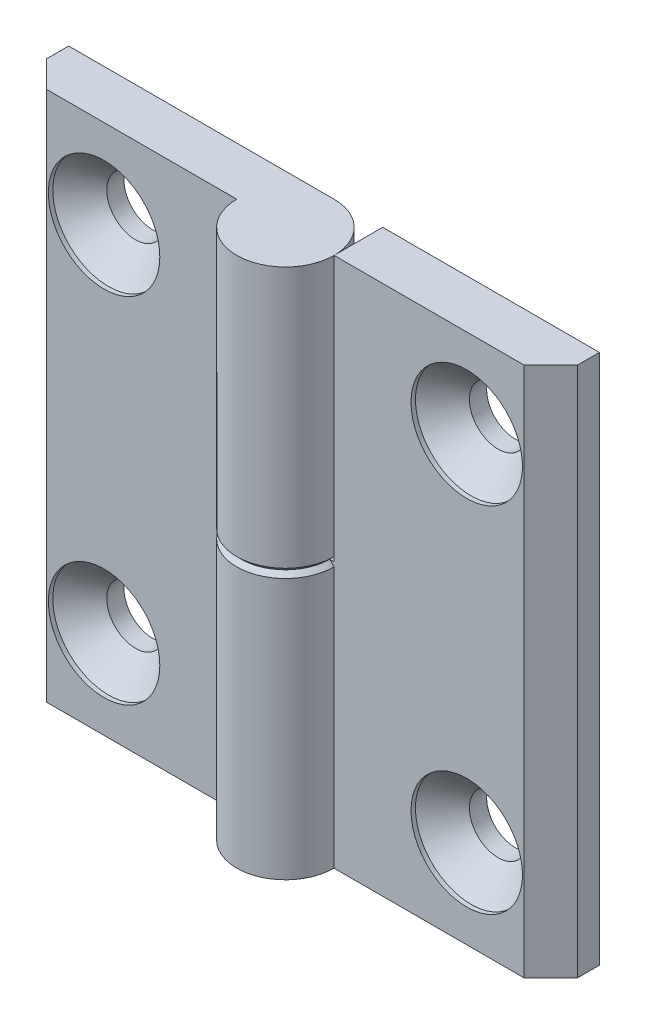
ISO-10303-21;
HEADER;
FILE_DESCRIPTION(('STEP AP214'),'2;1');
FILE_NAME('part.step','',(''),(''),'','','');
FILE_SCHEMA(('AUTOMOTIVE_DESIGN { 1 0 10303 214 1 1 1 1 }'));
ENDSEC;
DATA;
#1=APPLICATION_CONTEXT('core data for automotive mechanical design processes');
#2=APPLICATION_PROTOCOL_DEFINITION('international standard','automotive_design',2000,#1);
#3=PRODUCT_CONTEXT('',#1,'mechanical');
#4=PRODUCT('Part','Part','',(#3));
#5=PRODUCT_RELATED_PRODUCT_CATEGORY('part','',(#4));
#6=PRODUCT_DEFINITION_FORMATION('','',#4);
#7=PRODUCT_DEFINITION_CONTEXT('part definition',#1,'design');
#8=PRODUCT_DEFINITION('design','',#6,#7);
#9=PRODUCT_DEFINITION_SHAPE('','',#8);
#10=(LENGTH_UNIT() NAMED_UNIT(*) SI_UNIT(.MILLI.,.METRE.));
#11=(NAMED_UNIT(*) PLANE_ANGLE_UNIT() SI_UNIT($,.RADIAN.));
#12=(NAMED_UNIT(*) SI_UNIT($,.STERADIAN.) SOLID_ANGLE_UNIT());
#13=UNCERTAINTY_MEASURE_WITH_UNIT(LENGTH_MEASURE(1.E-05),#10,'distance_accuracy_value','');
#14=(GEOMETRIC_REPRESENTATION_CONTEXT(3) GLOBAL_UNCERTAINTY_ASSIGNED_CONTEXT((#13)) GLOBAL_UNIT_ASSIGNED_CONTEXT((#10,
#11,#12)) REPRESENTATION_CONTEXT('',''));
#15=CARTESIAN_POINT('',(0.,0.,0.));
#16=DIRECTION('',(0.,0.,1.));
#17=DIRECTION('',(1.,0.,0.));
#18=AXIS2_PLACEMENT_3D('',#15,#16,#17);
#19=CARTESIAN_POINT('',(0.,-30.,0.));
#20=DIRECTION('',(0.,1.,0.));
#21=DIRECTION('',(0.,0.,-1.));
#22=AXIS2_PLACEMENT_3D('',#19,#20,#21);
#23=CYLINDRICAL_SURFACE('',#22,5.5);
#24=DIRECTION('',(0.,1.,0.));
#25=VECTOR('',#24,1.);
#26=CARTESIAN_POINT('',(5.5,-30.,0.));
#27=LINE('',#26,#25);
#28=CARTESIAN_POINT('',(5.5,-30.,0.));
#29=VERTEX_POINT('',#28);
#30=CARTESIAN_POINT('',(5.5,-0.49999999999999,0.));
#31=VERTEX_POINT('',#30);
#32=EDGE_CURVE('E157',#29,#31,#27,.T.);
#33=ORIENTED_EDGE('',*,*,#32,.T.);
#34=CARTESIAN_POINT('',(0.,-0.49999999999999,0.));
#35=DIRECTION('',(0.,-1.,0.));
#36=DIRECTION('',(0.,0.,1.));
#37=AXIS2_PLACEMENT_3D('',#34,#35,#36);
#38=CIRCLE('',#37,5.5);
#39=CARTESIAN_POINT('',(0.,-0.49999999999999,-5.5));
#40=VERTEX_POINT('',#39);
#41=EDGE_CURVE('E175',#31,#40,#38,.T.);
#42=ORIENTED_EDGE('',*,*,#41,.T.);
#43=DIRECTION('',(0.,1.,0.));
#44=VECTOR('',#43,1.);
#45=CARTESIAN_POINT('',(0.,-30.,-5.5));
#46=LINE('',#45,#44);
#47=CARTESIAN_POINT('',(0.,-30.,-5.5));
#48=VERTEX_POINT('',#47);
#49=EDGE_CURVE('E167',#48,#40,#46,.T.);
#50=ORIENTED_EDGE('',*,*,#49,.F.);
#51=CARTESIAN_POINT('',(0.,-30.,0.));
#52=DIRECTION('',(0.,-1.,0.));
#53=DIRECTION('',(0.,0.,1.));
#54=AXIS2_PLACEMENT_3D('',#51,#52,#53);
#55=CIRCLE('',#54,5.5);
#56=EDGE_CURVE('E156',#29,#48,#55,.T.);
#57=ORIENTED_EDGE('',*,*,#56,.F.);
#58=EDGE_LOOP('',(#33,#42,#50,#57));
#59=FACE_BOUND('',#58,.T.);
#60=ADVANCED_FACE('F46',(#59),#23,.T.);
#61=CARTESIAN_POINT('',(0.,-30.,-5.5));
#62=DIRECTION('',(0.,0.,1.));
#63=DIRECTION('',(-1.,0.,0.));
#64=AXIS2_PLACEMENT_3D('',#61,#62,#63);
#65=PLANE('',#64);
#66=CARTESIAN_POINT('',(20.5,-20.,-5.50000000000015));
#67=DIRECTION('',(0.,0.,1.));
#68=DIRECTION('',(-1.,0.,0.));
#69=AXIS2_PLACEMENT_3D('',#66,#67,#68);
#70=CIRCLE('',#69,3.25);
#71=CARTESIAN_POINT('',(17.25,-20.,-5.50000000000013));
#72=VERTEX_POINT('',#71);
#73=EDGE_CURVE('E197',#72,#72,#70,.T.);
#74=ORIENTED_EDGE('',*,*,#73,.T.);
#75=EDGE_LOOP('',(#74));
#76=FACE_BOUND('',#75,.T.);
#77=CARTESIAN_POINT('',(20.5,20.,-5.50000000000015));
#78=DIRECTION('',(0.,0.,1.));
#79=DIRECTION('',(-1.,0.,0.));
#80=AXIS2_PLACEMENT_3D('',#77,#78,#79);
#81=CIRCLE('',#80,3.25);
#82=CARTESIAN_POINT('',(17.25,20.,-5.50000000000013));
#83=VERTEX_POINT('',#82);
#84=EDGE_CURVE('E139',#83,#83,#81,.T.);
#85=ORIENTED_EDGE('',*,*,#84,.T.);
#86=EDGE_LOOP('',(#85));
#87=FACE_BOUND('',#86,.T.);
#88=ORIENTED_EDGE('',*,*,#49,.T.);
#89=DIRECTION('',(1.,0.,0.));
#90=VECTOR('',#89,1.);
#91=CARTESIAN_POINT('',(0.,-0.49999999999999,-5.5));
#92=LINE('',#91,#90);
#93=CARTESIAN_POINT('',(5.49999999999996,-0.49999999999999,-5.50000000000004));
#94=VERTEX_POINT('',#93);
#95=EDGE_CURVE('E138',#40,#94,#92,.T.);
#96=ORIENTED_EDGE('',*,*,#95,.T.);
#97=DIRECTION('',(0.,1.,0.));
#98=VECTOR('',#97,1.);
#99=CARTESIAN_POINT('',(5.49999999999996,30.,-5.50000000000004));
#100=LINE('',#99,#98);
#101=CARTESIAN_POINT('',(5.49999999999996,30.,-5.50000000000004));
#102=VERTEX_POINT('',#101);
#103=EDGE_CURVE('E119',#94,#102,#100,.T.);
#104=ORIENTED_EDGE('',*,*,#103,.T.);
#105=DIRECTION('',(1.,0.,0.));
#106=VECTOR('',#105,1.);
#107=CARTESIAN_POINT('',(0.,30.,-5.5));
#108=LINE('',#107,#106);
#109=CARTESIAN_POINT('',(30.,30.,-5.50000000000022));
#110=VERTEX_POINT('',#109);
#111=EDGE_CURVE('E135',#102,#110,#108,.T.);
#112=ORIENTED_EDGE('',*,*,#111,.T.);
#113=DIRECTION('',(0.,1.,0.));
#114=VECTOR('',#113,1.);
#115=CARTESIAN_POINT('',(30.,-30.,-5.50000000000022));
#116=LINE('',#115,#114);
#117=CARTESIAN_POINT('',(30.,-30.,-5.50000000000022));
#118=VERTEX_POINT('',#117);
#119=EDGE_CURVE('E165',#118,#110,#116,.T.);
#120=ORIENTED_EDGE('',*,*,#119,.F.);
#121=DIRECTION('',(1.,0.,0.));
#122=VECTOR('',#121,1.);
#123=CARTESIAN_POINT('',(0.,-30.,-5.5));
#124=LINE('',#123,#122);
#125=EDGE_CURVE('E213',#48,#118,#124,.T.);
#126=ORIENTED_EDGE('',*,*,#125,.F.);
#127=EDGE_LOOP('',(#88,#96,#104,#112,#120,#126));
#128=FACE_BOUND('',#127,.T.);
#129=ADVANCED_FACE('F133',(#76,#87,#128),#65,.F.);
#130=CARTESIAN_POINT('',(30.,-30.,-5.50000000000022));
#131=DIRECTION('',(-1.,0.,0.));
#132=DIRECTION('',(0.,0.,-1.));
#133=AXIS2_PLACEMENT_3D('',#130,#131,#132);
#134=PLANE('',#133);
#135=DIRECTION('',(0.,0.,1.));
#136=VECTOR('',#135,1.);
#137=CARTESIAN_POINT('',(30.,30.,-5.50000000000022));
#138=LINE('',#137,#136);
#139=CARTESIAN_POINT('',(30.,30.,-3.00000000000022));
#140=VERTEX_POINT('',#139);
#141=EDGE_CURVE('E144',#110,#140,#138,.T.);
#142=ORIENTED_EDGE('',*,*,#141,.T.);
#143=DIRECTION('',(0.,1.,0.));
#144=VECTOR('',#143,1.);
#145=CARTESIAN_POINT('',(30.,-30.,-3.00000000000022));
#146=LINE('',#145,#144);
#147=CARTESIAN_POINT('',(30.,-30.,-3.00000000000022));
#148=VERTEX_POINT('',#147);
#149=EDGE_CURVE('E162',#148,#140,#146,.T.);
#150=ORIENTED_EDGE('',*,*,#149,.F.);
#151=DIRECTION('',(0.,0.,1.));
#152=VECTOR('',#151,1.);
#153=CARTESIAN_POINT('',(30.,-30.,-5.50000000000022));
#154=LINE('',#153,#152);
#155=EDGE_CURVE('E215',#118,#148,#154,.T.);
#156=ORIENTED_EDGE('',*,*,#155,.F.);
#157=ORIENTED_EDGE('',*,*,#119,.T.);
#158=EDGE_LOOP('',(#142,#150,#156,#157));
#159=FACE_BOUND('',#158,.T.);
#160=ADVANCED_FACE('F229',(#159),#134,.F.);
#161=CARTESIAN_POINT('',(30.,-30.,-3.00000000000022));
#162=DIRECTION('',(-0.707106781186549,0.,-0.707106781186546));
#163=DIRECTION('',(0.707106781186546,0.,-0.707106781186549));
#164=AXIS2_PLACEMENT_3D('',#161,#162,#163);
#165=PLANE('',#164);
#166=DIRECTION('',(-0.707106781186546,0.,0.707106781186549));
#167=VECTOR('',#166,1.);
#168=CARTESIAN_POINT('',(30.,30.,-3.00000000000022));
#169=LINE('',#168,#167);
#170=CARTESIAN_POINT('',(27.,30.,-2.0176617772832E-13));
#171=VERTEX_POINT('',#170);
#172=EDGE_CURVE('E146',#140,#171,#169,.T.);
#173=ORIENTED_EDGE('',*,*,#172,.T.);
#174=DIRECTION('',(0.,1.,0.));
#175=VECTOR('',#174,1.);
#176=CARTESIAN_POINT('',(27.,-30.,-2.0176617772832E-13));
#177=LINE('',#176,#175);
#178=CARTESIAN_POINT('',(27.,-30.,-2.0176617772832E-13));
#179=VERTEX_POINT('',#178);
#180=EDGE_CURVE('E159',#179,#171,#177,.T.);
#181=ORIENTED_EDGE('',*,*,#180,.F.);
#182=DIRECTION('',(-0.707106781186546,0.,0.707106781186549));
#183=VECTOR('',#182,1.);
#184=CARTESIAN_POINT('',(30.,-30.,-3.00000000000022));
#185=LINE('',#184,#183);
#186=EDGE_CURVE('E216',#148,#179,#185,.T.);
#187=ORIENTED_EDGE('',*,*,#186,.F.);
#188=ORIENTED_EDGE('',*,*,#149,.T.);
#189=EDGE_LOOP('',(#173,#181,#187,#188));
#190=FACE_BOUND('',#189,.T.);
#191=ADVANCED_FACE('F231',(#190),#165,.F.);
#192=CARTESIAN_POINT('',(27.,-30.,-2.0176617772832E-13));
#193=DIRECTION('',(0.,0.,-1.));
#194=DIRECTION('',(1.,0.,0.));
#195=AXIS2_PLACEMENT_3D('',#192,#193,#194);
#196=PLANE('',#195);
#197=CARTESIAN_POINT('',(20.5,-20.,-1.53409679080074E-13));
#198=DIRECTION('',(0.,0.,1.));
#199=DIRECTION('',(-1.,0.,0.));
#200=AXIS2_PLACEMENT_3D('',#197,#198,#199);
#201=CIRCLE('',#200,6.3);
#202=CARTESIAN_POINT('',(14.2,-20.,-1.06330904276799E-13));
#203=VERTEX_POINT('',#202);
#204=EDGE_CURVE('E185',#203,#203,#201,.T.);
#205=ORIENTED_EDGE('',*,*,#204,.F.);
#206=EDGE_LOOP('',(#205));
#207=FACE_BOUND('',#206,.T.);
#208=CARTESIAN_POINT('',(20.5,20.,-1.53409679080074E-13));
#209=DIRECTION('',(0.,0.,1.));
#210=DIRECTION('',(-1.,0.,0.));
#211=AXIS2_PLACEMENT_3D('',#208,#209,#210);
#212=CIRCLE('',#211,6.3);
#213=CARTESIAN_POINT('',(14.2,20.,-1.06330904276799E-13));
#214=VERTEX_POINT('',#213);
#215=EDGE_CURVE('E200',#214,#214,#212,.T.);
#216=ORIENTED_EDGE('',*,*,#215,.F.);
#217=EDGE_LOOP('',(#216));
#218=FACE_BOUND('',#217,.T.);
#219=DIRECTION('',(-1.,0.,0.));
#220=VECTOR('',#219,1.);
#221=CARTESIAN_POINT('',(27.,30.,-2.0176617772832E-13));
#222=LINE('',#221,#220);
#223=CARTESIAN_POINT('',(5.5,30.,0.));
#224=VERTEX_POINT('',#223);
#225=EDGE_CURVE('E154',#171,#224,#222,.T.);
#226=ORIENTED_EDGE('',*,*,#225,.T.);
#227=DIRECTION('',(0.,-1.,0.));
#228=VECTOR('',#227,1.);
#229=CARTESIAN_POINT('',(5.5,-30.,0.));
#230=LINE('',#229,#228);
#231=CARTESIAN_POINT('',(5.5,0.,0.));
#232=VERTEX_POINT('',#231);
#233=EDGE_CURVE('E123',#224,#232,#230,.T.);
#234=ORIENTED_EDGE('',*,*,#233,.T.);
#235=DIRECTION('',(1.,0.,0.));
#236=VECTOR('',#235,1.);
#237=CARTESIAN_POINT('',(-5.5,0.,0.));
#238=LINE('',#237,#236);
#239=CARTESIAN_POINT('',(5.00000000000001,0.,0.));
#240=VERTEX_POINT('',#239);
#241=EDGE_CURVE('E170',#240,#232,#238,.T.);
#242=ORIENTED_EDGE('',*,*,#241,.F.);
#243=DIRECTION('',(0.707106781186546,-0.707106781186549,0.));
#244=VECTOR('',#243,1.);
#245=CARTESIAN_POINT('',(0.,5.00000000000004,0.));
#246=LINE('',#245,#244);
#247=EDGE_CURVE('E12',#240,#31,#246,.T.);
#248=ORIENTED_EDGE('',*,*,#247,.T.);
#249=ORIENTED_EDGE('',*,*,#32,.F.);
#250=DIRECTION('',(-1.,0.,0.));
#251=VECTOR('',#250,1.);
#252=CARTESIAN_POINT('',(27.,-30.,-2.0176617772832E-13));
#253=LINE('',#252,#251);
#254=EDGE_CURVE('E150',#179,#29,#253,.T.);
#255=ORIENTED_EDGE('',*,*,#254,.F.);
#256=ORIENTED_EDGE('',*,*,#180,.T.);
#257=EDGE_LOOP('',(#226,#234,#242,#248,#249,#255,#256));
#258=FACE_BOUND('',#257,.T.);
#259=ADVANCED_FACE('F224',(#207,#218,#258),#196,.F.);
#260=CARTESIAN_POINT('',(0.,-30.,0.));
#261=DIRECTION('',(0.,-1.,0.));
#262=DIRECTION('',(0.,0.,1.));
#263=AXIS2_PLACEMENT_3D('',#260,#261,#262);
#264=PLANE('',#263);
#265=ORIENTED_EDGE('',*,*,#56,.T.);
#266=ORIENTED_EDGE('',*,*,#125,.T.);
#267=ORIENTED_EDGE('',*,*,#155,.T.);
#268=ORIENTED_EDGE('',*,*,#186,.T.);
#269=ORIENTED_EDGE('',*,*,#254,.T.);
#270=EDGE_LOOP('',(#265,#266,#267,#268,#269));
#271=FACE_BOUND('',#270,.T.);
#272=ADVANCED_FACE('F221',(#271),#264,.T.);
#273=CARTESIAN_POINT('',(0.,30.,0.));
#274=DIRECTION('',(0.,-1.,0.));
#275=DIRECTION('',(0.,0.,1.));
#276=AXIS2_PLACEMENT_3D('',#273,#274,#275);
#277=PLANE('',#276);
#278=ORIENTED_EDGE('',*,*,#111,.F.);
#279=DIRECTION('',(0.,0.,1.));
#280=VECTOR('',#279,1.);
#281=CARTESIAN_POINT('',(5.49999999999996,30.,-5.50000000000004));
#282=LINE('',#281,#280);
#283=EDGE_CURVE('E116',#102,#224,#282,.T.);
#284=ORIENTED_EDGE('',*,*,#283,.T.);
#285=ORIENTED_EDGE('',*,*,#225,.F.);
#286=ORIENTED_EDGE('',*,*,#172,.F.);
#287=ORIENTED_EDGE('',*,*,#141,.F.);
#288=EDGE_LOOP('',(#278,#284,#285,#286,#287));
#289=FACE_BOUND('',#288,.T.);
#290=ADVANCED_FACE('F142',(#289),#277,.F.);
#291=CARTESIAN_POINT('',(-5.50000000000004,0.,-5.49999999999996));
#292=DIRECTION('',(0.,-1.,0.));
#293=DIRECTION('',(0.,0.,1.));
#294=AXIS2_PLACEMENT_3D('',#291,#292,#293);
#295=PLANE('',#294);
#296=DIRECTION('',(0.,0.,1.));
#297=VECTOR('',#296,1.);
#298=CARTESIAN_POINT('',(5.49999999999996,0.,-5.50000000000004));
#299=LINE('',#298,#297);
#300=CARTESIAN_POINT('',(5.49999999999996,0.,-5.00000000000005));
#301=VERTEX_POINT('',#300);
#302=EDGE_CURVE('E128',#301,#232,#299,.T.);
#303=ORIENTED_EDGE('',*,*,#302,.F.);
#304=DIRECTION('',(-1.,0.,0.));
#305=VECTOR('',#304,1.);
#306=CARTESIAN_POINT('',(-5.50000000000004,0.,-4.99999999999997));
#307=LINE('',#306,#305);
#308=CARTESIAN_POINT('',(0.,0.,-5.00000000000001));
#309=VERTEX_POINT('',#308);
#310=EDGE_CURVE('E69',#301,#309,#307,.T.);
#311=ORIENTED_EDGE('',*,*,#310,.T.);
#312=CARTESIAN_POINT('',(0.,0.,0.));
#313=DIRECTION('',(0.,-1.,0.));
#314=DIRECTION('',(0.,0.,1.));
#315=AXIS2_PLACEMENT_3D('',#312,#313,#314);
#316=CIRCLE('',#315,5.00000000000001);
#317=EDGE_CURVE('E172',#309,#240,#316,.F.);
#318=ORIENTED_EDGE('',*,*,#317,.T.);
#319=ORIENTED_EDGE('',*,*,#241,.T.);
#320=EDGE_LOOP('',(#303,#311,#318,#319));
#321=FACE_BOUND('',#320,.T.);
#322=ADVANCED_FACE('F178',(#321),#295,.F.);
#323=CARTESIAN_POINT('',(5.49999999999996,30.,-5.50000000000004));
#324=DIRECTION('',(1.,0.,0.));
#325=DIRECTION('',(0.,0.,1.));
#326=AXIS2_PLACEMENT_3D('',#323,#324,#325);
#327=PLANE('',#326);
#328=ORIENTED_EDGE('',*,*,#283,.F.);
#329=ORIENTED_EDGE('',*,*,#103,.F.);
#330=DIRECTION('',(0.,-0.70710678118655,-0.707106781186546));
#331=VECTOR('',#330,1.);
#332=CARTESIAN_POINT('',(5.50000000000007,14.7500000000001,9.74999999999996));
#333=LINE('',#332,#331);
#334=EDGE_CURVE('E56',#94,#301,#333,.F.);
#335=ORIENTED_EDGE('',*,*,#334,.T.);
#336=ORIENTED_EDGE('',*,*,#302,.T.);
#337=ORIENTED_EDGE('',*,*,#233,.F.);
#338=EDGE_LOOP('',(#328,#329,#335,#336,#337));
#339=FACE_BOUND('',#338,.T.);
#340=ADVANCED_FACE('F118',(#339),#327,.F.);
#341=CARTESIAN_POINT('',(20.5,20.,-1.53192838645577E-13));
#342=DIRECTION('',(0.,0.,1.));
#343=DIRECTION('',(-1.,0.,0.));
#344=AXIS2_PLACEMENT_3D('',#341,#342,#343);
#345=CYLINDRICAL_SURFACE('',#344,3.25);
#346=ORIENTED_EDGE('',*,*,#84,.F.);
#347=EDGE_LOOP('',(#346));
#348=FACE_BOUND('',#347,.T.);
#349=CARTESIAN_POINT('',(20.5,20.,-3.55000000000015));
#350=DIRECTION('',(0.,0.,1.));
#351=DIRECTION('',(-1.,0.,0.));
#352=AXIS2_PLACEMENT_3D('',#349,#350,#351);
#353=CIRCLE('',#352,3.25);
#354=CARTESIAN_POINT('',(17.25,20.,-3.55000000000013));
#355=VERTEX_POINT('',#354);
#356=EDGE_CURVE('E206',#355,#355,#353,.T.);
#357=ORIENTED_EDGE('',*,*,#356,.T.);
#358=EDGE_LOOP('',(#357));
#359=FACE_BOUND('',#358,.T.);
#360=ADVANCED_FACE('F269',(#348,#359),#345,.F.);
#361=CARTESIAN_POINT('',(20.5,20.,-0.500000000000153));
#362=DIRECTION('',(0.,0.,1.));
#363=DIRECTION('',(-1.,0.,0.));
#364=AXIS2_PLACEMENT_3D('',#361,#362,#363);
#365=CONICAL_SURFACE('',#364,6.3,0.785398163397449);
#366=ORIENTED_EDGE('',*,*,#356,.F.);
#367=EDGE_LOOP('',(#366));
#368=FACE_BOUND('',#367,.T.);
#369=CARTESIAN_POINT('',(20.5,20.,-0.500000000000153));
#370=DIRECTION('',(0.,0.,1.));
#371=DIRECTION('',(-1.,0.,0.));
#372=AXIS2_PLACEMENT_3D('',#369,#370,#371);
#373=CIRCLE('',#372,6.3);
#374=CARTESIAN_POINT('',(14.2,20.,-0.500000000000106));
#375=VERTEX_POINT('',#374);
#376=EDGE_CURVE('E203',#375,#375,#373,.T.);
#377=ORIENTED_EDGE('',*,*,#376,.T.);
#378=EDGE_LOOP('',(#377));
#379=FACE_BOUND('',#378,.T.);
#380=ADVANCED_FACE('F272',(#368,#379),#365,.F.);
#381=CARTESIAN_POINT('',(20.5,20.,-1.53192838645577E-13));
#382=DIRECTION('',(0.,0.,1.));
#383=DIRECTION('',(-1.,0.,0.));
#384=AXIS2_PLACEMENT_3D('',#381,#382,#383);
#385=CYLINDRICAL_SURFACE('',#384,6.3);
#386=ORIENTED_EDGE('',*,*,#376,.F.);
#387=EDGE_LOOP('',(#386));
#388=FACE_BOUND('',#387,.T.);
#389=ORIENTED_EDGE('',*,*,#215,.T.);
#390=EDGE_LOOP('',(#389));
#391=FACE_BOUND('',#390,.T.);
#392=ADVANCED_FACE('F276',(#388,#391),#385,.F.);
#393=CARTESIAN_POINT('',(20.5,-20.,-1.53192838645577E-13));
#394=DIRECTION('',(0.,0.,1.));
#395=DIRECTION('',(-1.,0.,0.));
#396=AXIS2_PLACEMENT_3D('',#393,#394,#395);
#397=CYLINDRICAL_SURFACE('',#396,3.25);
#398=ORIENTED_EDGE('',*,*,#73,.F.);
#399=EDGE_LOOP('',(#398));
#400=FACE_BOUND('',#399,.T.);
#401=CARTESIAN_POINT('',(20.5,-20.,-3.55000000000015));
#402=DIRECTION('',(0.,0.,1.));
#403=DIRECTION('',(-1.,0.,0.));
#404=AXIS2_PLACEMENT_3D('',#401,#402,#403);
#405=CIRCLE('',#404,3.25);
#406=CARTESIAN_POINT('',(17.25,-20.,-3.55000000000013));
#407=VERTEX_POINT('',#406);
#408=EDGE_CURVE('E192',#407,#407,#405,.T.);
#409=ORIENTED_EDGE('',*,*,#408,.T.);
#410=EDGE_LOOP('',(#409));
#411=FACE_BOUND('',#410,.T.);
#412=ADVANCED_FACE('F280',(#400,#411),#397,.F.);
#413=CARTESIAN_POINT('',(20.5,-20.,-0.500000000000153));
#414=DIRECTION('',(0.,0.,1.));
#415=DIRECTION('',(-1.,0.,0.));
#416=AXIS2_PLACEMENT_3D('',#413,#414,#415);
#417=CONICAL_SURFACE('',#416,6.3,0.785398163397449);
#418=ORIENTED_EDGE('',*,*,#408,.F.);
#419=EDGE_LOOP('',(#418));
#420=FACE_BOUND('',#419,.T.);
#421=CARTESIAN_POINT('',(20.5,-20.,-0.500000000000153));
#422=DIRECTION('',(0.,0.,1.));
#423=DIRECTION('',(-1.,0.,0.));
#424=AXIS2_PLACEMENT_3D('',#421,#422,#423);
#425=CIRCLE('',#424,6.3);
#426=CARTESIAN_POINT('',(14.2,-20.,-0.500000000000106));
#427=VERTEX_POINT('',#426);
#428=EDGE_CURVE('E187',#427,#427,#425,.T.);
#429=ORIENTED_EDGE('',*,*,#428,.T.);
#430=EDGE_LOOP('',(#429));
#431=FACE_BOUND('',#430,.T.);
#432=ADVANCED_FACE('F238',(#420,#431),#417,.F.);
#433=CARTESIAN_POINT('',(20.5,-20.,-1.53192838645577E-13));
#434=DIRECTION('',(0.,0.,1.));
#435=DIRECTION('',(-1.,0.,0.));
#436=AXIS2_PLACEMENT_3D('',#433,#434,#435);
#437=CYLINDRICAL_SURFACE('',#436,6.3);
#438=ORIENTED_EDGE('',*,*,#428,.F.);
#439=EDGE_LOOP('',(#438));
#440=FACE_BOUND('',#439,.T.);
#441=ORIENTED_EDGE('',*,*,#204,.T.);
#442=EDGE_LOOP('',(#441));
#443=FACE_BOUND('',#442,.T.);
#444=ADVANCED_FACE('F233',(#440,#443),#437,.F.);
#445=CARTESIAN_POINT('',(0.,-0.49999999999999,0.));
#446=DIRECTION('',(0.,-1.,0.));
#447=DIRECTION('',(0.,0.,1.));
#448=AXIS2_PLACEMENT_3D('',#445,#446,#447);
#449=CONICAL_SURFACE('',#448,5.5,0.785398163397446);
#450=ORIENTED_EDGE('',*,*,#247,.F.);
#451=ORIENTED_EDGE('',*,*,#317,.F.);
#452=DIRECTION('',(0.,0.707106781186549,0.707106781186546));
#453=VECTOR('',#452,1.);
#454=CARTESIAN_POINT('',(0.,-0.49999999999999,-5.5));
#455=LINE('',#454,#453);
#456=EDGE_CURVE('E51',#40,#309,#455,.T.);
#457=ORIENTED_EDGE('',*,*,#456,.F.);
#458=ORIENTED_EDGE('',*,*,#41,.F.);
#459=EDGE_LOOP('',(#450,#451,#457,#458));
#460=FACE_BOUND('',#459,.T.);
#461=ADVANCED_FACE('F49',(#460),#449,.T.);
#462=CARTESIAN_POINT('',(0.,-0.49999999999999,-5.5));
#463=DIRECTION('',(0.,-0.707106781186546,0.70710678118655));
#464=DIRECTION('',(1.,0.,0.));
#465=AXIS2_PLACEMENT_3D('',#462,#463,#464);
#466=PLANE('',#465);
#467=ORIENTED_EDGE('',*,*,#456,.T.);
#468=ORIENTED_EDGE('',*,*,#310,.F.);
#469=ORIENTED_EDGE('',*,*,#334,.F.);
#470=ORIENTED_EDGE('',*,*,#95,.F.);
#471=EDGE_LOOP('',(#467,#468,#469,#470));
#472=FACE_BOUND('',#471,.T.);
#473=ADVANCED_FACE('F181',(#472),#466,.F.);
#474=CLOSED_SHELL('',(#60,#129,#160,#191,#259,#272,#290,#322,#340,#360,#380,#392,#412,#432,#444,
#461,#473));
#475=MANIFOLD_SOLID_BREP('B2',#474);
#476=CARTESIAN_POINT('',(0.,30.,0.));
#477=DIRECTION('',(0.,-1.,0.));
#478=DIRECTION('',(0.,0.,-1.));
#479=AXIS2_PLACEMENT_3D('',#476,#477,#478);
#480=CYLINDRICAL_SURFACE('',#479,5.5);
#481=DIRECTION('',(0.,-1.,0.));
#482=VECTOR('',#481,1.);
#483=CARTESIAN_POINT('',(-5.5,30.,0.));
#484=LINE('',#483,#482);
#485=CARTESIAN_POINT('',(-5.5,30.,0.));
#486=VERTEX_POINT('',#485);
#487=CARTESIAN_POINT('',(-5.5,0.49999999999999,0.));
#488=VERTEX_POINT('',#487);
#489=EDGE_CURVE('E512',#486,#488,#484,.T.);
#490=ORIENTED_EDGE('',*,*,#489,.T.);
#491=CARTESIAN_POINT('',(0.,0.49999999999999,0.));
#492=DIRECTION('',(0.,1.,0.));
#493=DIRECTION('',(0.,0.,1.));
#494=AXIS2_PLACEMENT_3D('',#491,#492,#493);
#495=CIRCLE('',#494,5.5);
#496=CARTESIAN_POINT('',(0.,0.49999999999999,-5.5));
#497=VERTEX_POINT('',#496);
#498=EDGE_CURVE('E530',#488,#497,#495,.T.);
#499=ORIENTED_EDGE('',*,*,#498,.T.);
#500=DIRECTION('',(0.,-1.,0.));
#501=VECTOR('',#500,1.);
#502=CARTESIAN_POINT('',(0.,30.,-5.5));
#503=LINE('',#502,#501);
#504=CARTESIAN_POINT('',(0.,30.,-5.5));
#505=VERTEX_POINT('',#504);
#506=EDGE_CURVE('E522',#505,#497,#503,.T.);
#507=ORIENTED_EDGE('',*,*,#506,.F.);
#508=CARTESIAN_POINT('',(0.,30.,0.));
#509=DIRECTION('',(0.,1.,0.));
#510=DIRECTION('',(0.,0.,1.));
#511=AXIS2_PLACEMENT_3D('',#508,#509,#510);
#512=CIRCLE('',#511,5.5);
#513=EDGE_CURVE('E511',#486,#505,#512,.T.);
#514=ORIENTED_EDGE('',*,*,#513,.F.);
#515=EDGE_LOOP('',(#490,#499,#507,#514));
#516=FACE_BOUND('',#515,.T.);
#517=ADVANCED_FACE('F401',(#516),#480,.T.);
#518=CARTESIAN_POINT('',(0.,30.,-5.5));
#519=DIRECTION('',(0.,0.,1.));
#520=DIRECTION('',(1.,0.,0.));
#521=AXIS2_PLACEMENT_3D('',#518,#519,#520);
#522=PLANE('',#521);
#523=CARTESIAN_POINT('',(-20.5,20.,-5.5));
#524=DIRECTION('',(0.,0.,1.));
#525=DIRECTION('',(1.,0.,0.));
#526=AXIS2_PLACEMENT_3D('',#523,#524,#525);
#527=CIRCLE('',#526,3.25);
#528=CARTESIAN_POINT('',(-17.25,20.,-5.5));
#529=VERTEX_POINT('',#528);
#530=EDGE_CURVE('E552',#529,#529,#527,.T.);
#531=ORIENTED_EDGE('',*,*,#530,.T.);
#532=EDGE_LOOP('',(#531));
#533=FACE_BOUND('',#532,.T.);
#534=CARTESIAN_POINT('',(-20.5,-20.,-5.5));
#535=DIRECTION('',(0.,0.,1.));
#536=DIRECTION('',(1.,0.,0.));
#537=AXIS2_PLACEMENT_3D('',#534,#535,#536);
#538=CIRCLE('',#537,3.25);
#539=CARTESIAN_POINT('',(-17.25,-20.,-5.5));
#540=VERTEX_POINT('',#539);
#541=EDGE_CURVE('E494',#540,#540,#538,.T.);
#542=ORIENTED_EDGE('',*,*,#541,.T.);
#543=EDGE_LOOP('',(#542));
#544=FACE_BOUND('',#543,.T.);
#545=ORIENTED_EDGE('',*,*,#506,.T.);
#546=DIRECTION('',(-1.,0.,0.));
#547=VECTOR('',#546,1.);
#548=CARTESIAN_POINT('',(0.,0.49999999999999,-5.5));
#549=LINE('',#548,#547);
#550=CARTESIAN_POINT('',(-5.5,0.49999999999999,-5.5));
#551=VERTEX_POINT('',#550);
#552=EDGE_CURVE('E493',#497,#551,#549,.T.);
#553=ORIENTED_EDGE('',*,*,#552,.T.);
#554=DIRECTION('',(0.,-1.,0.));
#555=VECTOR('',#554,1.);
#556=CARTESIAN_POINT('',(-5.5,-30.,-5.5));
#557=LINE('',#556,#555);
#558=CARTESIAN_POINT('',(-5.5,-30.,-5.5));
#559=VERTEX_POINT('',#558);
#560=EDGE_CURVE('E474',#551,#559,#557,.T.);
#561=ORIENTED_EDGE('',*,*,#560,.T.);
#562=DIRECTION('',(-1.,0.,0.));
#563=VECTOR('',#562,1.);
#564=CARTESIAN_POINT('',(0.,-30.,-5.5));
#565=LINE('',#564,#563);
#566=CARTESIAN_POINT('',(-30.,-30.,-5.5));
#567=VERTEX_POINT('',#566);
#568=EDGE_CURVE('E490',#559,#567,#565,.T.);
#569=ORIENTED_EDGE('',*,*,#568,.T.);
#570=DIRECTION('',(0.,-1.,0.));
#571=VECTOR('',#570,1.);
#572=CARTESIAN_POINT('',(-30.,30.,-5.5));
#573=LINE('',#572,#571);
#574=CARTESIAN_POINT('',(-30.,30.,-5.5));
#575=VERTEX_POINT('',#574);
#576=EDGE_CURVE('E520',#575,#567,#573,.T.);
#577=ORIENTED_EDGE('',*,*,#576,.F.);
#578=DIRECTION('',(-1.,0.,0.));
#579=VECTOR('',#578,1.);
#580=CARTESIAN_POINT('',(0.,30.,-5.5));
#581=LINE('',#580,#579);
#582=EDGE_CURVE('E568',#505,#575,#581,.T.);
#583=ORIENTED_EDGE('',*,*,#582,.F.);
#584=EDGE_LOOP('',(#545,#553,#561,#569,#577,#583));
#585=FACE_BOUND('',#584,.T.);
#586=ADVANCED_FACE('F488',(#533,#544,#585),#522,.F.);
#587=CARTESIAN_POINT('',(-30.,30.,-5.5));
#588=DIRECTION('',(1.,0.,0.));
#589=DIRECTION('',(0.,0.,-1.));
#590=AXIS2_PLACEMENT_3D('',#587,#588,#589);
#591=PLANE('',#590);
#592=DIRECTION('',(0.,0.,1.));
#593=VECTOR('',#592,1.);
#594=CARTESIAN_POINT('',(-30.,-30.,-5.5));
#595=LINE('',#594,#593);
#596=CARTESIAN_POINT('',(-30.,-30.,-3.));
#597=VERTEX_POINT('',#596);
#598=EDGE_CURVE('E499',#567,#597,#595,.T.);
#599=ORIENTED_EDGE('',*,*,#598,.T.);
#600=DIRECTION('',(0.,-1.,0.));
#601=VECTOR('',#600,1.);
#602=CARTESIAN_POINT('',(-30.,30.,-3.));
#603=LINE('',#602,#601);
#604=CARTESIAN_POINT('',(-30.,30.,-3.));
#605=VERTEX_POINT('',#604);
#606=EDGE_CURVE('E517',#605,#597,#603,.T.);
#607=ORIENTED_EDGE('',*,*,#606,.F.);
#608=DIRECTION('',(0.,0.,1.));
#609=VECTOR('',#608,1.);
#610=CARTESIAN_POINT('',(-30.,30.,-5.5));
#611=LINE('',#610,#609);
#612=EDGE_CURVE('E570',#575,#605,#611,.T.);
#613=ORIENTED_EDGE('',*,*,#612,.F.);
#614=ORIENTED_EDGE('',*,*,#576,.T.);
#615=EDGE_LOOP('',(#599,#607,#613,#614));
#616=FACE_BOUND('',#615,.T.);
#617=ADVANCED_FACE('F584',(#616),#591,.F.);
#618=CARTESIAN_POINT('',(-30.,30.,-3.));
#619=DIRECTION('',(0.707106781186543,0.,-0.707106781186552));
#620=DIRECTION('',(-0.707106781186552,0.,-0.707106781186543));
#621=AXIS2_PLACEMENT_3D('',#618,#619,#620);
#622=PLANE('',#621);
#623=DIRECTION('',(0.707106781186552,0.,0.707106781186543));
#624=VECTOR('',#623,1.);
#625=CARTESIAN_POINT('',(-30.,-30.,-3.));
#626=LINE('',#625,#624);
#627=CARTESIAN_POINT('',(-27.,-30.,0.));
#628=VERTEX_POINT('',#627);
#629=EDGE_CURVE('E501',#597,#628,#626,.T.);
#630=ORIENTED_EDGE('',*,*,#629,.T.);
#631=DIRECTION('',(0.,-1.,0.));
#632=VECTOR('',#631,1.);
#633=CARTESIAN_POINT('',(-27.,30.,0.));
#634=LINE('',#633,#632);
#635=CARTESIAN_POINT('',(-27.,30.,0.));
#636=VERTEX_POINT('',#635);
#637=EDGE_CURVE('E514',#636,#628,#634,.T.);
#638=ORIENTED_EDGE('',*,*,#637,.F.);
#639=DIRECTION('',(0.707106781186552,0.,0.707106781186543));
#640=VECTOR('',#639,1.);
#641=CARTESIAN_POINT('',(-30.,30.,-3.));
#642=LINE('',#641,#640);
#643=EDGE_CURVE('E571',#605,#636,#642,.T.);
#644=ORIENTED_EDGE('',*,*,#643,.F.);
#645=ORIENTED_EDGE('',*,*,#606,.T.);
#646=EDGE_LOOP('',(#630,#638,#644,#645));
#647=FACE_BOUND('',#646,.T.);
#648=ADVANCED_FACE('F586',(#647),#622,.F.);
#649=CARTESIAN_POINT('',(-27.,30.,0.));
#650=DIRECTION('',(0.,0.,-1.));
#651=DIRECTION('',(-1.,0.,0.));
#652=AXIS2_PLACEMENT_3D('',#649,#650,#651);
#653=PLANE('',#652);
#654=CARTESIAN_POINT('',(-20.5,20.,0.));
#655=DIRECTION('',(0.,0.,1.));
#656=DIRECTION('',(1.,0.,0.));
#657=AXIS2_PLACEMENT_3D('',#654,#655,#656);
#658=CIRCLE('',#657,6.3);
#659=CARTESIAN_POINT('',(-14.2,20.,0.));
#660=VERTEX_POINT('',#659);
#661=EDGE_CURVE('E540',#660,#660,#658,.T.);
#662=ORIENTED_EDGE('',*,*,#661,.F.);
#663=EDGE_LOOP('',(#662));
#664=FACE_BOUND('',#663,.T.);
#665=CARTESIAN_POINT('',(-20.5,-20.,0.));
#666=DIRECTION('',(0.,0.,1.));
#667=DIRECTION('',(1.,0.,0.));
#668=AXIS2_PLACEMENT_3D('',#665,#666,#667);
#669=CIRCLE('',#668,6.3);
#670=CARTESIAN_POINT('',(-14.2,-20.,0.));
#671=VERTEX_POINT('',#670);
#672=EDGE_CURVE('E555',#671,#671,#669,.T.);
#673=ORIENTED_EDGE('',*,*,#672,.F.);
#674=EDGE_LOOP('',(#673));
#675=FACE_BOUND('',#674,.T.);
#676=DIRECTION('',(1.,0.,0.));
#677=VECTOR('',#676,1.);
#678=CARTESIAN_POINT('',(-27.,-30.,0.));
#679=LINE('',#678,#677);
#680=CARTESIAN_POINT('',(-5.5,-30.,0.));
#681=VERTEX_POINT('',#680);
#682=EDGE_CURVE('E509',#628,#681,#679,.T.);
#683=ORIENTED_EDGE('',*,*,#682,.T.);
#684=DIRECTION('',(0.,1.,0.));
#685=VECTOR('',#684,1.);
#686=CARTESIAN_POINT('',(-5.5,30.,0.));
#687=LINE('',#686,#685);
#688=CARTESIAN_POINT('',(-5.5,0.,0.));
#689=VERTEX_POINT('',#688);
#690=EDGE_CURVE('E478',#681,#689,#687,.T.);
#691=ORIENTED_EDGE('',*,*,#690,.T.);
#692=DIRECTION('',(-1.,0.,0.));
#693=VECTOR('',#692,1.);
#694=CARTESIAN_POINT('',(5.5,0.,0.));
#695=LINE('',#694,#693);
#696=CARTESIAN_POINT('',(-5.00000000000001,0.,0.));
#697=VERTEX_POINT('',#696);
#698=EDGE_CURVE('E525',#697,#689,#695,.T.);
#699=ORIENTED_EDGE('',*,*,#698,.F.);
#700=DIRECTION('',(-0.707106781186546,0.707106781186549,0.));
#701=VECTOR('',#700,1.);
#702=CARTESIAN_POINT('',(0.,-5.00000000000004,0.));
#703=LINE('',#702,#701);
#704=EDGE_CURVE('E44',#697,#488,#703,.T.);
#705=ORIENTED_EDGE('',*,*,#704,.T.);
#706=ORIENTED_EDGE('',*,*,#489,.F.);
#707=DIRECTION('',(1.,0.,0.));
#708=VECTOR('',#707,1.);
#709=CARTESIAN_POINT('',(-27.,30.,0.));
#710=LINE('',#709,#708);
#711=EDGE_CURVE('E505',#636,#486,#710,.T.);
#712=ORIENTED_EDGE('',*,*,#711,.F.);
#713=ORIENTED_EDGE('',*,*,#637,.T.);
#714=EDGE_LOOP('',(#683,#691,#699,#705,#706,#712,#713));
#715=FACE_BOUND('',#714,.T.);
#716=ADVANCED_FACE('F579',(#664,#675,#715),#653,.F.);
#717=CARTESIAN_POINT('',(0.,30.,0.));
#718=DIRECTION('',(0.,1.,0.));
#719=DIRECTION('',(0.,0.,1.));
#720=AXIS2_PLACEMENT_3D('',#717,#718,#719);
#721=PLANE('',#720);
#722=ORIENTED_EDGE('',*,*,#513,.T.);
#723=ORIENTED_EDGE('',*,*,#582,.T.);
#724=ORIENTED_EDGE('',*,*,#612,.T.);
#725=ORIENTED_EDGE('',*,*,#643,.T.);
#726=ORIENTED_EDGE('',*,*,#711,.T.);
#727=EDGE_LOOP('',(#722,#723,#724,#725,#726));
#728=FACE_BOUND('',#727,.T.);
#729=ADVANCED_FACE('F576',(#728),#721,.T.);
#730=CARTESIAN_POINT('',(0.,-30.,0.));
#731=DIRECTION('',(0.,1.,0.));
#732=DIRECTION('',(0.,0.,1.));
#733=AXIS2_PLACEMENT_3D('',#730,#731,#732);
#734=PLANE('',#733);
#735=ORIENTED_EDGE('',*,*,#568,.F.);
#736=DIRECTION('',(0.,0.,1.));
#737=VECTOR('',#736,1.);
#738=CARTESIAN_POINT('',(-5.5,-30.,-5.5));
#739=LINE('',#738,#737);
#740=EDGE_CURVE('E471',#559,#681,#739,.T.);
#741=ORIENTED_EDGE('',*,*,#740,.T.);
#742=ORIENTED_EDGE('',*,*,#682,.F.);
#743=ORIENTED_EDGE('',*,*,#629,.F.);
#744=ORIENTED_EDGE('',*,*,#598,.F.);
#745=EDGE_LOOP('',(#735,#741,#742,#743,#744));
#746=FACE_BOUND('',#745,.T.);
#747=ADVANCED_FACE('F497',(#746),#734,.F.);
#748=CARTESIAN_POINT('',(5.5,0.,-5.5));
#749=DIRECTION('',(0.,1.,0.));
#750=DIRECTION('',(0.,0.,1.));
#751=AXIS2_PLACEMENT_3D('',#748,#749,#750);
#752=PLANE('',#751);
#753=DIRECTION('',(0.,0.,1.));
#754=VECTOR('',#753,1.);
#755=CARTESIAN_POINT('',(-5.5,0.,-5.5));
#756=LINE('',#755,#754);
#757=CARTESIAN_POINT('',(-5.5,0.,-5.00000000000001));
#758=VERTEX_POINT('',#757);
#759=EDGE_CURVE('E483',#758,#689,#756,.T.);
#760=ORIENTED_EDGE('',*,*,#759,.F.);
#761=DIRECTION('',(1.,0.,0.));
#762=VECTOR('',#761,1.);
#763=CARTESIAN_POINT('',(5.5,0.,-5.00000000000001));
#764=LINE('',#763,#762);
#765=CARTESIAN_POINT('',(0.,0.,-5.00000000000001));
#766=VERTEX_POINT('',#765);
#767=EDGE_CURVE('E424',#758,#766,#764,.T.);
#768=ORIENTED_EDGE('',*,*,#767,.T.);
#769=CARTESIAN_POINT('',(0.,0.,0.));
#770=DIRECTION('',(0.,1.,0.));
#771=DIRECTION('',(0.,0.,1.));
#772=AXIS2_PLACEMENT_3D('',#769,#770,#771);
#773=CIRCLE('',#772,5.00000000000001);
#774=EDGE_CURVE('E527',#766,#697,#773,.F.);
#775=ORIENTED_EDGE('',*,*,#774,.T.);
#776=ORIENTED_EDGE('',*,*,#698,.T.);
#777=EDGE_LOOP('',(#760,#768,#775,#776));
#778=FACE_BOUND('',#777,.T.);
#779=ADVANCED_FACE('F533',(#778),#752,.F.);
#780=CARTESIAN_POINT('',(-5.5,-30.,-5.5));
#781=DIRECTION('',(-1.,0.,0.));
#782=DIRECTION('',(0.,0.,1.));
#783=AXIS2_PLACEMENT_3D('',#780,#781,#782);
#784=PLANE('',#783);
#785=ORIENTED_EDGE('',*,*,#740,.F.);
#786=ORIENTED_EDGE('',*,*,#560,.F.);
#787=DIRECTION('',(0.,0.70710678118655,-0.707106781186546));
#788=VECTOR('',#787,1.);
#789=CARTESIAN_POINT('',(-5.5,-14.7500000000001,9.75));
#790=LINE('',#789,#788);
#791=EDGE_CURVE('E411',#551,#758,#790,.F.);
#792=ORIENTED_EDGE('',*,*,#791,.T.);
#793=ORIENTED_EDGE('',*,*,#759,.T.);
#794=ORIENTED_EDGE('',*,*,#690,.F.);
#795=EDGE_LOOP('',(#785,#786,#792,#793,#794));
#796=FACE_BOUND('',#795,.T.);
#797=ADVANCED_FACE('F473',(#796),#784,.F.);
#798=CARTESIAN_POINT('',(-20.5,-20.,0.));
#799=DIRECTION('',(0.,0.,1.));
#800=DIRECTION('',(1.,0.,0.));
#801=AXIS2_PLACEMENT_3D('',#798,#799,#800);
#802=CYLINDRICAL_SURFACE('',#801,3.25);
#803=ORIENTED_EDGE('',*,*,#541,.F.);
#804=EDGE_LOOP('',(#803));
#805=FACE_BOUND('',#804,.T.);
#806=CARTESIAN_POINT('',(-20.5,-20.,-3.55));
#807=DIRECTION('',(0.,0.,1.));
#808=DIRECTION('',(1.,0.,0.));
#809=AXIS2_PLACEMENT_3D('',#806,#807,#808);
#810=CIRCLE('',#809,3.25);
#811=CARTESIAN_POINT('',(-17.25,-20.,-3.55));
#812=VERTEX_POINT('',#811);
#813=EDGE_CURVE('E561',#812,#812,#810,.T.);
#814=ORIENTED_EDGE('',*,*,#813,.T.);
#815=EDGE_LOOP('',(#814));
#816=FACE_BOUND('',#815,.T.);
#817=ADVANCED_FACE('F624',(#805,#816),#802,.F.);
#818=CARTESIAN_POINT('',(-20.5,-20.,-0.5));
#819=DIRECTION('',(0.,0.,1.));
#820=DIRECTION('',(1.,0.,0.));
#821=AXIS2_PLACEMENT_3D('',#818,#819,#820);
#822=CONICAL_SURFACE('',#821,6.3,0.785398163397449);
#823=ORIENTED_EDGE('',*,*,#813,.F.);
#824=EDGE_LOOP('',(#823));
#825=FACE_BOUND('',#824,.T.);
#826=CARTESIAN_POINT('',(-20.5,-20.,-0.5));
#827=DIRECTION('',(0.,0.,1.));
#828=DIRECTION('',(1.,0.,0.));
#829=AXIS2_PLACEMENT_3D('',#826,#827,#828);
#830=CIRCLE('',#829,6.3);
#831=CARTESIAN_POINT('',(-14.2,-20.,-0.5));
#832=VERTEX_POINT('',#831);
#833=EDGE_CURVE('E558',#832,#832,#830,.T.);
#834=ORIENTED_EDGE('',*,*,#833,.T.);
#835=EDGE_LOOP('',(#834));
#836=FACE_BOUND('',#835,.T.);
#837=ADVANCED_FACE('F627',(#825,#836),#822,.F.);
#838=CARTESIAN_POINT('',(-20.5,-20.,0.));
#839=DIRECTION('',(0.,0.,1.));
#840=DIRECTION('',(1.,0.,0.));
#841=AXIS2_PLACEMENT_3D('',#838,#839,#840);
#842=CYLINDRICAL_SURFACE('',#841,6.3);
#843=ORIENTED_EDGE('',*,*,#833,.F.);
#844=EDGE_LOOP('',(#843));
#845=FACE_BOUND('',#844,.T.);
#846=ORIENTED_EDGE('',*,*,#672,.T.);
#847=EDGE_LOOP('',(#846));
#848=FACE_BOUND('',#847,.T.);
#849=ADVANCED_FACE('F631',(#845,#848),#842,.F.);
#850=CARTESIAN_POINT('',(-20.5,20.,0.));
#851=DIRECTION('',(0.,0.,1.));
#852=DIRECTION('',(1.,0.,0.));
#853=AXIS2_PLACEMENT_3D('',#850,#851,#852);
#854=CYLINDRICAL_SURFACE('',#853,3.25);
#855=ORIENTED_EDGE('',*,*,#530,.F.);
#856=EDGE_LOOP('',(#855));
#857=FACE_BOUND('',#856,.T.);
#858=CARTESIAN_POINT('',(-20.5,20.,-3.55));
#859=DIRECTION('',(0.,0.,1.));
#860=DIRECTION('',(1.,0.,0.));
#861=AXIS2_PLACEMENT_3D('',#858,#859,#860);
#862=CIRCLE('',#861,3.25);
#863=CARTESIAN_POINT('',(-17.25,20.,-3.55));
#864=VERTEX_POINT('',#863);
#865=EDGE_CURVE('E547',#864,#864,#862,.T.);
#866=ORIENTED_EDGE('',*,*,#865,.T.);
#867=EDGE_LOOP('',(#866));
#868=FACE_BOUND('',#867,.T.);
#869=ADVANCED_FACE('F635',(#857,#868),#854,.F.);
#870=CARTESIAN_POINT('',(-20.5,20.,-0.5));
#871=DIRECTION('',(0.,0.,1.));
#872=DIRECTION('',(1.,0.,0.));
#873=AXIS2_PLACEMENT_3D('',#870,#871,#872);
#874=CONICAL_SURFACE('',#873,6.3,0.785398163397449);
#875=ORIENTED_EDGE('',*,*,#865,.F.);
#876=EDGE_LOOP('',(#875));
#877=FACE_BOUND('',#876,.T.);
#878=CARTESIAN_POINT('',(-20.5,20.,-0.5));
#879=DIRECTION('',(0.,0.,1.));
#880=DIRECTION('',(1.,0.,0.));
#881=AXIS2_PLACEMENT_3D('',#878,#879,#880);
#882=CIRCLE('',#881,6.3);
#883=CARTESIAN_POINT('',(-14.2,20.,-0.5));
#884=VERTEX_POINT('',#883);
#885=EDGE_CURVE('E542',#884,#884,#882,.T.);
#886=ORIENTED_EDGE('',*,*,#885,.T.);
#887=EDGE_LOOP('',(#886));
#888=FACE_BOUND('',#887,.T.);
#889=ADVANCED_FACE('F593',(#877,#888),#874,.F.);
#890=CARTESIAN_POINT('',(-20.5,20.,0.));
#891=DIRECTION('',(0.,0.,1.));
#892=DIRECTION('',(1.,0.,0.));
#893=AXIS2_PLACEMENT_3D('',#890,#891,#892);
#894=CYLINDRICAL_SURFACE('',#893,6.3);
#895=ORIENTED_EDGE('',*,*,#885,.F.);
#896=EDGE_LOOP('',(#895));
#897=FACE_BOUND('',#896,.T.);
#898=ORIENTED_EDGE('',*,*,#661,.T.);
#899=EDGE_LOOP('',(#898));
#900=FACE_BOUND('',#899,.T.);
#901=ADVANCED_FACE('F588',(#897,#900),#894,.F.);
#902=CARTESIAN_POINT('',(0.,0.49999999999999,0.));
#903=DIRECTION('',(0.,1.,0.));
#904=DIRECTION('',(0.,0.,1.));
#905=AXIS2_PLACEMENT_3D('',#902,#903,#904);
#906=CONICAL_SURFACE('',#905,5.5,0.785398163397446);
#907=ORIENTED_EDGE('',*,*,#704,.F.);
#908=ORIENTED_EDGE('',*,*,#774,.F.);
#909=DIRECTION('',(0.,-0.707106781186549,0.707106781186546));
#910=VECTOR('',#909,1.);
#911=CARTESIAN_POINT('',(0.,0.49999999999999,-5.5));
#912=LINE('',#911,#910);
#913=EDGE_CURVE('E406',#497,#766,#912,.T.);
#914=ORIENTED_EDGE('',*,*,#913,.F.);
#915=ORIENTED_EDGE('',*,*,#498,.F.);
#916=EDGE_LOOP('',(#907,#908,#914,#915));
#917=FACE_BOUND('',#916,.T.);
#918=ADVANCED_FACE('F404',(#917),#906,.T.);
#919=CARTESIAN_POINT('',(0.,0.49999999999999,-5.5));
#920=DIRECTION('',(0.,0.707106781186546,0.70710678118655));
#921=DIRECTION('',(-1.,0.,0.));
#922=AXIS2_PLACEMENT_3D('',#919,#920,#921);
#923=PLANE('',#922);
#924=ORIENTED_EDGE('',*,*,#913,.T.);
#925=ORIENTED_EDGE('',*,*,#767,.F.);
#926=ORIENTED_EDGE('',*,*,#791,.F.);
#927=ORIENTED_EDGE('',*,*,#552,.F.);
#928=EDGE_LOOP('',(#924,#925,#926,#927));
#929=FACE_BOUND('',#928,.T.);
#930=ADVANCED_FACE('F536',(#929),#923,.F.);
#931=CLOSED_SHELL('',(#517,#586,#617,#648,#716,#729,#747,#779,#797,#817,#837,#849,#869,#889,
#901,#918,#930));
#932=MANIFOLD_SOLID_BREP('B6',#931);
#933=ADVANCED_BREP_SHAPE_REPRESENTATION('',(#18,#475,#932),#14);
#934=SHAPE_DEFINITION_REPRESENTATION(#9,#933);
ENDSEC;
END-ISO-10303-21;
